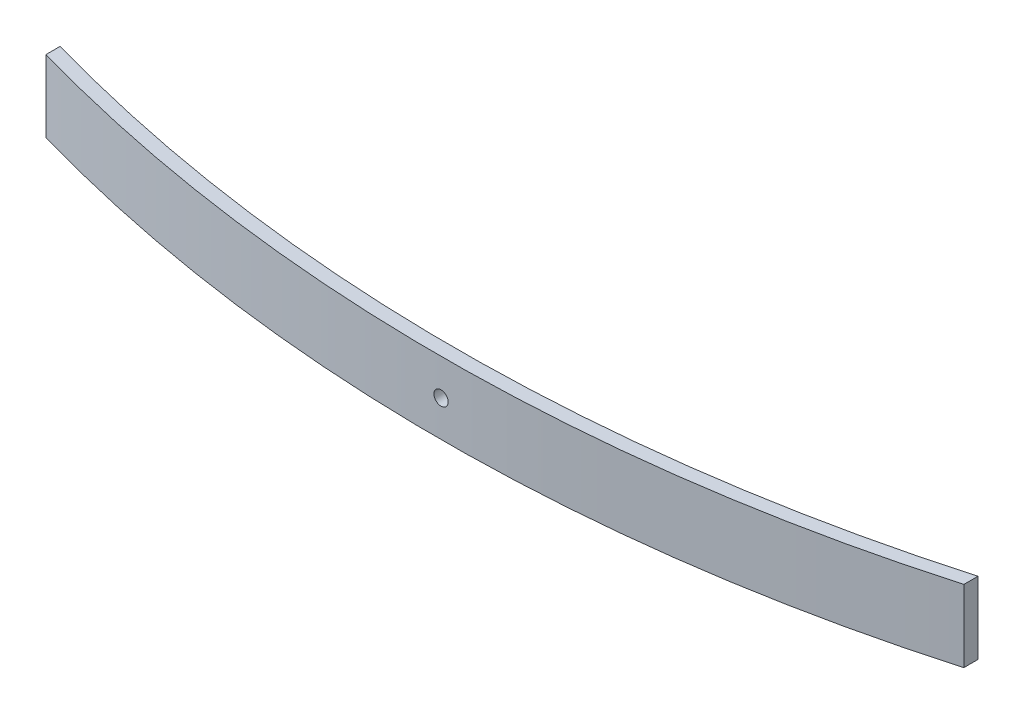
ISO-10303-21;
HEADER;
FILE_DESCRIPTION(('STEP AP214'),'2;1');
FILE_NAME('part.step','',(''),(''),'','','');
FILE_SCHEMA(('AUTOMOTIVE_DESIGN { 1 0 10303 214 1 1 1 1 }'));
ENDSEC;
DATA;
#1=APPLICATION_CONTEXT('core data for automotive mechanical design processes');
#2=APPLICATION_PROTOCOL_DEFINITION('international standard','automotive_design',2000,#1);
#3=PRODUCT_CONTEXT('',#1,'mechanical');
#4=PRODUCT('Part','Part','',(#3));
#5=PRODUCT_RELATED_PRODUCT_CATEGORY('part','',(#4));
#6=PRODUCT_DEFINITION_FORMATION('','',#4);
#7=PRODUCT_DEFINITION_CONTEXT('part definition',#1,'design');
#8=PRODUCT_DEFINITION('design','',#6,#7);
#9=PRODUCT_DEFINITION_SHAPE('','',#8);
#10=(LENGTH_UNIT() NAMED_UNIT(*) SI_UNIT(.MILLI.,.METRE.));
#11=(NAMED_UNIT(*) PLANE_ANGLE_UNIT() SI_UNIT($,.RADIAN.));
#12=(NAMED_UNIT(*) SI_UNIT($,.STERADIAN.) SOLID_ANGLE_UNIT());
#13=UNCERTAINTY_MEASURE_WITH_UNIT(LENGTH_MEASURE(1.E-05),#10,'distance_accuracy_value','');
#14=(GEOMETRIC_REPRESENTATION_CONTEXT(3) GLOBAL_UNCERTAINTY_ASSIGNED_CONTEXT((#13)) GLOBAL_UNIT_ASSIGNED_CONTEXT((#10,
#11,#12)) REPRESENTATION_CONTEXT('',''));
#15=CARTESIAN_POINT('',(0.,0.,0.));
#16=DIRECTION('',(0.,0.,1.));
#17=DIRECTION('',(1.,0.,0.));
#18=AXIS2_PLACEMENT_3D('',#15,#16,#17);
#19=CARTESIAN_POINT('',(5.63227548411192E-13,76.2,-1568.04997748713));
#20=DIRECTION('',(0.,-1.,0.));
#21=DIRECTION('',(0.,0.,-1.));
#22=AXIS2_PLACEMENT_3D('',#19,#20,#21);
#23=CYLINDRICAL_SURFACE('',#22,1776.04997748713);
#24=CARTESIAN_POINT('',(5.63227548411192E-13,0.,-1568.04997748713));
#25=DIRECTION('',(0.,1.,0.));
#26=DIRECTION('',(0.,0.,1.));
#27=AXIS2_PLACEMENT_3D('',#24,#25,#26);
#28=CIRCLE('',#27,1776.04997748713);
#29=CARTESIAN_POINT('',(485.021699517167,0.,140.4895958121));
#30=VERTEX_POINT('',#29);
#31=CARTESIAN_POINT('',(-485.021699517165,0.,140.4895958121));
#32=VERTEX_POINT('',#31);
#33=EDGE_CURVE('E122',#30,#32,#28,.F.);
#34=ORIENTED_EDGE('',*,*,#33,.F.);
#35=DIRECTION('',(0.,-1.,0.));
#36=VECTOR('',#35,1.);
#37=CARTESIAN_POINT('',(485.021699517167,76.2,140.4895958121));
#38=LINE('',#37,#36);
#39=CARTESIAN_POINT('',(485.021699517167,76.2,140.4895958121));
#40=VERTEX_POINT('',#39);
#41=EDGE_CURVE('E11',#40,#30,#38,.T.);
#42=ORIENTED_EDGE('',*,*,#41,.F.);
#43=CARTESIAN_POINT('',(5.63227548411192E-13,76.2,-1568.04997748713));
#44=DIRECTION('',(0.,1.,0.));
#45=DIRECTION('',(0.,0.,1.));
#46=AXIS2_PLACEMENT_3D('',#43,#44,#45);
#47=CIRCLE('',#46,1776.04997748713);
#48=CARTESIAN_POINT('',(-485.021699517165,76.2,140.4895958121));
#49=VERTEX_POINT('',#48);
#50=EDGE_CURVE('E115',#40,#49,#47,.F.);
#51=ORIENTED_EDGE('',*,*,#50,.T.);
#52=DIRECTION('',(0.,-1.,0.));
#53=VECTOR('',#52,1.);
#54=CARTESIAN_POINT('',(-485.021699517165,76.2,140.4895958121));
#55=LINE('',#54,#53);
#56=EDGE_CURVE('E94',#49,#32,#55,.T.);
#57=ORIENTED_EDGE('',*,*,#56,.T.);
#58=EDGE_LOOP('',(#34,#42,#51,#57));
#59=FACE_BOUND('',#58,.T.);
#60=CARTESIAN_POINT('',(5.63227548411192E-13,30.6,208.));
#61=CARTESIAN_POINT('',(-0.210713968094355,30.5999984867718,208.000000017793));
#62=CARTESIAN_POINT('',(-0.421403110930435,30.6088837241473,207.999962421728));
#63=CARTESIAN_POINT('',(-0.841354181845203,30.6443626478278,207.999813125687));
#64=CARTESIAN_POINT('',(-1.05061571988385,30.6709609920997,207.999701406219));
#65=CARTESIAN_POINT('',(-1.46633777348665,30.7417152082758,207.999406859924));
#66=CARTESIAN_POINT('',(-1.67279562512332,30.7858867143382,207.999223969782));
#67=CARTESIAN_POINT('',(-2.08132982906143,30.8914915499315,207.998792209094));
#68=CARTESIAN_POINT('',(-2.28340455125366,30.9529311869031,207.99854331444));
#69=CARTESIAN_POINT('',(-2.68152110119513,31.0925814227027,207.997986836868));
#70=CARTESIAN_POINT('',(-2.8775668723038,31.1707807807114,207.9976792933));
#71=CARTESIAN_POINT('',(-3.26237590887513,31.343419913298,207.997014137911));
#72=CARTESIAN_POINT('',(-3.45113906456097,31.4378599325676,207.996656525334));
#73=CARTESIAN_POINT('',(-3.81998780495984,31.6422805388216,207.995901490769));
#74=CARTESIAN_POINT('',(-4.00007570143485,31.7522569546404,207.995504079474));
#75=CARTESIAN_POINT('',(-4.35035222525608,31.9869905222909,207.994680636078));
#76=CARTESIAN_POINT('',(-4.52054062300119,32.1117480167396,207.994254603313));
#77=CARTESIAN_POINT('',(-4.84979170206691,32.3751451316166,207.993386048449));
#78=CARTESIAN_POINT('',(-5.00885520931077,32.5137837196362,207.992943527578));
#79=CARTESIAN_POINT('',(-5.31479308067797,32.8040158599571,207.992054369382));
#80=CARTESIAN_POINT('',(-5.4616632047591,32.9556138817968,207.991607730686));
#81=CARTESIAN_POINT('',(-5.74206362701614,33.2705952098564,207.990723311728));
#82=CARTESIAN_POINT('',(-5.87559815641345,33.4339747494297,207.990285528692));
#83=CARTESIAN_POINT('',(-6.12847828337024,33.7714630692386,207.989430939818));
#84=CARTESIAN_POINT('',(-6.24781862373899,33.9455757887629,207.989014141786));
#85=CARTESIAN_POINT('',(-6.47138111476831,34.303200530957,207.988213616074));
#86=CARTESIAN_POINT('',(-6.5756063932153,34.4867105983515,207.987829881559));
#87=CARTESIAN_POINT('',(-6.76822875919954,34.8618615632204,207.987106273531));
#88=CARTESIAN_POINT('',(-6.8566256006593,35.0535025870457,207.986766400699));
#89=CARTESIAN_POINT('',(-7.01695887812269,35.4435460971776,207.986140178145));
#90=CARTESIAN_POINT('',(-7.08889566823621,35.6419484379206,207.98585382727));
#91=CARTESIAN_POINT('',(-7.21580133308602,36.0441127387915,207.985342762279));
#92=CARTESIAN_POINT('',(-7.27076981084051,36.2478748241923,207.985118049605));
#93=CARTESIAN_POINT('',(-7.3633369917847,36.6592665254966,207.984736685149));
#94=CARTESIAN_POINT('',(-7.40093897454978,36.8668954034649,207.984580020515));
#95=CARTESIAN_POINT('',(-7.45853120590767,37.284654948294,207.984339094535));
#96=CARTESIAN_POINT('',(-7.47851535225068,37.4947864564639,207.984254858275));
#97=CARTESIAN_POINT('',(-7.5007035967929,37.9159102543567,207.984161289859));
#98=CARTESIAN_POINT('',(-7.50291408330494,38.12690220753,207.98415193079));
#99=CARTESIAN_POINT('',(-7.48955360463758,38.5484004665778,207.984208322118));
#100=CARTESIAN_POINT('',(-7.47397607404447,38.758906564384,207.984274100248));
#101=CARTESIAN_POINT('',(-7.42514452560696,39.177816026816,207.984478922777));
#102=CARTESIAN_POINT('',(-7.39189401428345,39.3862198002115,207.984617952642));
#103=CARTESIAN_POINT('',(-7.30795445093896,39.799488675094,207.984965325868));
#104=CARTESIAN_POINT('',(-7.25726512758638,40.0043537214696,207.985173670308));
#105=CARTESIAN_POINT('',(-7.13880941808665,40.4090816554469,207.985653753507));
#106=CARTESIAN_POINT('',(-7.07104334628338,40.6089446350508,207.9859254911));
#107=CARTESIAN_POINT('',(-6.9189140997811,41.0022558470399,207.986524655178));
#108=CARTESIAN_POINT('',(-6.83455053674644,41.1957039292103,207.986852082966));
#109=CARTESIAN_POINT('',(-6.64984230973407,41.5747716673118,207.987553267696));
#110=CARTESIAN_POINT('',(-6.54950055498276,41.7603927405774,207.9879270162));
#111=CARTESIAN_POINT('',(-6.33350673998455,42.1225834438656,207.988710406047));
#112=CARTESIAN_POINT('',(-6.21784939085673,42.2991499177422,207.989120059772));
#113=CARTESIAN_POINT('',(-5.97209494733994,42.6418601532704,207.98996341449));
#114=CARTESIAN_POINT('',(-5.84200303653234,42.8080076231481,207.990397106822));
#115=CARTESIAN_POINT('',(-5.56830511634755,43.1287715124284,207.99127634415));
#116=CARTESIAN_POINT('',(-5.42469413510178,43.2833836517495,207.991721893463));
#117=CARTESIAN_POINT('',(-4.97502421482223,43.728168500476,207.993057195178));
#118=CARTESIAN_POINT('',(-4.64986305950523,43.9996590137954,207.993946551662));
#119=CARTESIAN_POINT('',(-4.13197567971263,44.3627081259286,207.995201923407));
#120=CARTESIAN_POINT('',(-3.95423770702147,44.4764002086071,207.99560743072));
#121=CARTESIAN_POINT('',(-3.58980904910994,44.688450679073,207.996381434127));
#122=CARTESIAN_POINT('',(-3.40311815449547,44.7868087079932,207.996749929354));
#123=CARTESIAN_POINT('',(-2.83165300721137,45.0576661242203,207.99778332722));
#124=CARTESIAN_POINT('',(-2.43517114126777,45.2061693090256,207.998376934446));
#125=CARTESIAN_POINT('',(-1.62308827124603,45.4344169166339,207.999304792558));
#126=CARTESIAN_POINT('',(-1.20748726904302,45.5141613461806,207.999639043471));
#127=CARTESIAN_POINT('',(-0.368800144783707,45.6027859953174,208.000011208188));
#128=CARTESIAN_POINT('',(0.0542859194174483,45.6116667624026,208.000049124283));
#129=CARTESIAN_POINT('',(0.896132618130838,45.5581931101372,207.999823726226));
#130=CARTESIAN_POINT('',(1.31489325255124,45.4958386892741,207.999560412068));
#131=CARTESIAN_POINT('',(1.93034367877353,45.3504066256681,207.998962948761));
#132=CARTESIAN_POINT('',(2.13346696571742,45.2932419084604,207.998729895662));
#133=CARTESIAN_POINT('',(2.53416331768141,45.1620457959662,207.998203357605));
#134=CARTESIAN_POINT('',(2.73173651249186,45.0880147954716,207.997909874061));
#135=CARTESIAN_POINT('',(3.31406084676297,44.8412313409883,207.996950242197));
#136=CARTESIAN_POINT('',(3.68878109502314,44.6437020734129,207.996204537468));
#137=CARTESIAN_POINT('',(4.2214817885536,44.3027303934533,207.994991984489));
#138=CARTESIAN_POINT('',(4.39423732139167,44.1815494254653,207.99457188216));
#139=CARTESIAN_POINT('',(4.72893486876232,43.925076010294,207.993712173886));
#140=CARTESIAN_POINT('',(4.89088085068062,43.7897887877035,207.993272575197));
#141=CARTESIAN_POINT('',(5.2028389741046,43.5060131269227,207.992386135608));
#142=CARTESIAN_POINT('',(5.35284682055907,43.3575199778823,207.991939292171));
#143=CARTESIAN_POINT('',(5.63977310900379,43.0484737070597,207.99105133538));
#144=CARTESIAN_POINT('',(5.77669606336983,42.8879247771164,207.990610220096));
#145=CARTESIAN_POINT('',(6.03655633591662,42.5558335361284,207.989746002998));
#146=CARTESIAN_POINT('',(6.15949097179744,42.3842891264948,207.989322904648));
#147=CARTESIAN_POINT('',(6.39046942201523,42.0314575902562,207.98850682996));
#148=CARTESIAN_POINT('',(6.49851358458251,41.8501706916281,207.988113852919));
#149=CARTESIAN_POINT('',(6.69894774113194,41.4791360457972,207.987369158747));
#150=CARTESIAN_POINT('',(6.79133744698049,41.2893881429437,207.987017442377));
#151=CARTESIAN_POINT('',(6.95980221242444,40.9027865931228,207.986365267457));
#152=CARTESIAN_POINT('',(7.03587752593875,40.705933056804,207.986064808109));
#153=CARTESIAN_POINT('',(7.17118720449912,40.3064792017959,207.985523618733));
#154=CARTESIAN_POINT('',(7.23041839084972,40.1038778063372,207.985282899979));
#155=CARTESIAN_POINT('',(7.33158072491739,39.6944803968456,207.98486817799));
#156=CARTESIAN_POINT('',(7.37351824975517,39.4876859585838,207.984694150165));
#157=CARTESIAN_POINT('',(7.43983858987235,39.0712246263163,207.984417572838));
#158=CARTESIAN_POINT('',(7.4642150889778,38.8615567264145,207.984315049055));
#159=CARTESIAN_POINT('',(7.49521005598158,38.4409854893945,207.984184515178));
#160=CARTESIAN_POINT('',(7.50183466739308,38.2300826050058,207.984156479306));
#161=CARTESIAN_POINT('',(7.49729604901427,37.8084313167292,207.984175644233));
#162=CARTESIAN_POINT('',(7.48612970385176,37.5976829463638,207.984222858209));
#163=CARTESIAN_POINT('',(7.44608319144547,37.1778810074965,207.984391205324));
#164=CARTESIAN_POINT('',(7.41720343879291,36.9688273994438,207.984512336734));
#165=CARTESIAN_POINT('',(7.34193498439921,36.5538917028778,207.984825082016));
#166=CARTESIAN_POINT('',(7.29554590651523,36.3480096825967,207.985016697403));
#167=CARTESIAN_POINT('',(7.18558954382438,35.940888673502,207.985464967259));
#168=CARTESIAN_POINT('',(7.12202252604803,35.7396496125665,207.985721620717));
#169=CARTESIAN_POINT('',(6.97814667319743,35.3431999543693,207.986292743016));
#170=CARTESIAN_POINT('',(6.89783430858557,35.1479906380157,207.986607224045));
#171=CARTESIAN_POINT('',(6.72107980430777,34.7651040508121,207.987284909401));
#172=CARTESIAN_POINT('',(6.62464362886664,34.5774240265771,207.987648095704));
#173=CARTESIAN_POINT('',(6.4162729052852,34.210795083937,207.988413096412));
#174=CARTESIAN_POINT('',(6.30433343128906,34.0318489650877,207.988814923083));
#175=CARTESIAN_POINT('',(6.06581689289934,33.684084736122,207.989645553125));
#176=CARTESIAN_POINT('',(5.93924490882288,33.5152631415669,207.990074347111));
#177=CARTESIAN_POINT('',(5.67231991868927,33.1888660580896,207.990946907972));
#178=CARTESIAN_POINT('',(5.53196570521919,33.031291556578,207.991390676157));
#179=CARTESIAN_POINT('',(5.23848659589233,32.728528501031,207.992280544971));
#180=CARTESIAN_POINT('',(5.08536199605376,32.583339660053,207.992726645546));
#181=CARTESIAN_POINT('',(4.76738488124505,32.3063385507571,207.993608647806));
#182=CARTESIAN_POINT('',(4.60252923302726,32.1745298791339,207.994044546725));
#183=CARTESIAN_POINT('',(4.26230143452273,31.9252727160437,207.994893638276));
#184=CARTESIAN_POINT('',(4.08692944268934,31.8078240082911,207.99530683125));
#185=CARTESIAN_POINT('',(3.7267922464464,31.5880456665331,207.996099052417));
#186=CARTESIAN_POINT('',(3.54202080718466,31.4857262486001,207.996478057458));
#187=CARTESIAN_POINT('',(3.16457932589543,31.2970641063271,207.997190684132));
#188=CARTESIAN_POINT('',(2.97191219636474,31.2107155544448,207.997524322307));
#189=CARTESIAN_POINT('',(2.58015719959604,31.0546324777028,207.998136625653));
#190=CARTESIAN_POINT('',(2.38107520557386,30.9848832197952,207.998415339535));
#191=CARTESIAN_POINT('',(1.97781144430207,30.8624129523239,207.998910200255));
#192=CARTESIAN_POINT('',(1.77363103212953,30.8096874689386,207.999126363529));
#193=CARTESIAN_POINT('',(1.31020489979084,30.7106430274462,207.999535351372));
#194=CARTESIAN_POINT('',(1.04990557260813,30.6691871109607,207.99970896714));
#195=CARTESIAN_POINT('',(0.526391255000924,30.6138665423076,207.999941280342));
#196=CARTESIAN_POINT('',(0.263176264593045,30.6000018899827,207.999999977777));
#197=CARTESIAN_POINT('',(5.63227548411192E-13,30.6,208.));
#198=B_SPLINE_CURVE_WITH_KNOTS('',3,(#60,#61,#62,#63,#64,#65,#66,#67,#68,#69,#70,#71,#72,#73,
#74,#75,#76,#77,#78,#79,#80,#81,#82,#83,#84,#85,#86,#87,#88,#89,#90,#91,#92,#93,#94,#95,#96,#97,
#98,#99,#100,#101,#102,#103,#104,#105,#106,#107,#108,#109,#110,#111,#112,#113,#114,#115,#116,
#117,#118,#119,#120,#121,#122,#123,#124,#125,#126,#127,#128,#129,#130,#131,#132,#133,#134,#135,
#136,#137,#138,#139,#140,#141,#142,#143,#144,#145,#146,#147,#148,#149,#150,#151,#152,#153,#154,
#155,#156,#157,#158,#159,#160,#161,#162,#163,#164,#165,#166,#167,#168,#169,#170,#171,#172,#173,
#174,#175,#176,#177,#178,#179,#180,#181,#182,#183,#184,#185,#186,#187,#188,#189,#190,#191,#192,
#193,#194,#195,#196,#197),.UNSPECIFIED.,.T.,.F.,(4,2,2,2,2,2,2,2,2,2,2,2,2,2,2,2,2,2,2,2,2,2,2,
2,2,2,2,2,2,2,2,2,2,2,2,2,2,2,2,2,2,2,2,2,2,2,2,2,2,2,2,2,2,2,2,2,2,2,2,2,2,2,2,2,2,2,2,2,4),
(0.,0.631912024301777,1.2639902864152,1.89663214600144,2.52950538839113,3.16195548087539,
3.79441510307562,4.4267052459563,5.0590100478297,5.69126785680884,6.32374460980309,
6.95602004377835,7.58852893310258,8.22090674891289,8.85329439515874,9.48566843538514,
10.1180572691842,10.7503266306474,11.3828149038618,12.0150758342728,12.6475702025455,
13.2799391235442,13.9123178840565,14.5446850047721,15.177066922899,15.8093338315781,
16.4418196509556,17.0740790696136,17.7065719276866,18.9702098092056,19.602583667419,
20.2349723230349,21.4986105469059,22.7622486468442,24.0258769838608,25.2895053477042,
25.9218869189979,26.5542536895501,27.8178774792359,28.450372115571,29.0826333187677,
29.7151209754032,30.3473897231102,30.9797795065627,31.6121544983652,32.2445411283047,
32.8769179149983,33.5094139599539,34.1416765599364,34.7741664524213,35.4064374266601,
36.0388191299599,36.6711860326123,37.3035665208154,37.9359371792494,38.5684412619989,
39.2007118959496,39.8331838838019,40.4654369370645,41.097745429307,41.7300392686787,
42.3625026260201,42.9949564562123,43.6278354202829,44.2604829982539,44.892566944869,
45.5244846453389,46.3137263294984,47.1029680091572),.UNSPECIFIED.);
#199=CARTESIAN_POINT('',(5.63227548411192E-13,30.6,208.));
#200=VERTEX_POINT('',#199);
#201=EDGE_CURVE('E125',#200,#200,#198,.T.);
#202=ORIENTED_EDGE('',*,*,#201,.T.);
#203=EDGE_LOOP('',(#202));
#204=FACE_BOUND('',#203,.T.);
#205=ADVANCED_FACE('F49',(#59,#204),#23,.T.);
#206=CARTESIAN_POINT('',(6.91954253005793E-13,76.2,-1583.04997748713));
#207=DIRECTION('',(0.,-1.,0.));
#208=DIRECTION('',(0.,0.,-1.));
#209=AXIS2_PLACEMENT_3D('',#206,#207,#208);
#210=CYLINDRICAL_SURFACE('',#209,1776.04997748713);
#211=CARTESIAN_POINT('',(6.91954253005793E-13,0.,-1583.04997748713));
#212=DIRECTION('',(0.,1.,0.));
#213=DIRECTION('',(0.,0.,1.));
#214=AXIS2_PLACEMENT_3D('',#211,#212,#213);
#215=CIRCLE('',#214,1776.04997748713);
#216=CARTESIAN_POINT('',(485.021699517167,0.,125.4895958121));
#217=VERTEX_POINT('',#216);
#218=CARTESIAN_POINT('',(-485.021699517165,0.,125.4895958121));
#219=VERTEX_POINT('',#218);
#220=EDGE_CURVE('E87',#217,#219,#215,.F.);
#221=ORIENTED_EDGE('',*,*,#220,.T.);
#222=DIRECTION('',(0.,-1.,0.));
#223=VECTOR('',#222,1.);
#224=CARTESIAN_POINT('',(-485.021699517165,76.2,125.4895958121));
#225=LINE('',#224,#223);
#226=CARTESIAN_POINT('',(-485.021699517165,76.2,125.4895958121));
#227=VERTEX_POINT('',#226);
#228=EDGE_CURVE('E108',#227,#219,#225,.T.);
#229=ORIENTED_EDGE('',*,*,#228,.F.);
#230=CARTESIAN_POINT('',(6.91954253005793E-13,76.2,-1583.04997748713));
#231=DIRECTION('',(0.,1.,0.));
#232=DIRECTION('',(0.,0.,1.));
#233=AXIS2_PLACEMENT_3D('',#230,#231,#232);
#234=CIRCLE('',#233,1776.04997748713);
#235=CARTESIAN_POINT('',(485.021699517167,76.2,125.4895958121));
#236=VERTEX_POINT('',#235);
#237=EDGE_CURVE('E110',#236,#227,#234,.F.);
#238=ORIENTED_EDGE('',*,*,#237,.F.);
#239=DIRECTION('',(0.,-1.,0.));
#240=VECTOR('',#239,1.);
#241=CARTESIAN_POINT('',(485.021699517167,76.2,125.4895958121));
#242=LINE('',#241,#240);
#243=EDGE_CURVE('E64',#236,#217,#242,.T.);
#244=ORIENTED_EDGE('',*,*,#243,.T.);
#245=EDGE_LOOP('',(#221,#229,#238,#244));
#246=FACE_BOUND('',#245,.T.);
#247=CARTESIAN_POINT('',(-7.5,38.1,192.984164226377));
#248=CARTESIAN_POINT('',(-7.50000151322819,38.3107139680855,192.984164208571));
#249=CARTESIAN_POINT('',(-7.49111627585349,38.5214031109122,192.984201804954));
#250=CARTESIAN_POINT('',(-7.45563735217615,38.9413541818078,192.984351102375));
#251=CARTESIAN_POINT('',(-7.42903900790671,39.1506157198367,192.984462822905));
#252=CARTESIAN_POINT('',(-7.35828479173724,39.56633777342,192.984757371678));
#253=CARTESIAN_POINT('',(-7.31411328567894,39.7727956250468,192.984940263235));
#254=CARTESIAN_POINT('',(-7.208508450096,40.181329828965,192.985372027225));
#255=CARTESIAN_POINT('',(-7.14706881313061,40.3834045511471,192.985620923766));
#256=CARTESIAN_POINT('',(-7.00741857734594,40.781521101067,192.98617740523));
#257=CARTESIAN_POINT('',(-6.92921921934607,40.9775668721644,192.986484950802));
#258=CARTESIAN_POINT('',(-6.75658008677935,41.362375908714,192.987150110131));
#259=CARTESIAN_POINT('',(-6.66214006752074,41.5511390643896,192.987507724643));
#260=CARTESIAN_POINT('',(-6.45771946129041,41.9199878047696,192.988262762777));
#261=CARTESIAN_POINT('',(-6.34774304548433,42.1000757012362,192.988660175705));
#262=CARTESIAN_POINT('',(-6.11300947786033,42.4503522250429,192.989483621892));
#263=CARTESIAN_POINT('',(-5.98825198342546,42.6205406227819,192.989909655814));
#264=CARTESIAN_POINT('',(-5.72485486856214,42.9497917018563,192.990778212374));
#265=CARTESIAN_POINT('',(-5.58621628054089,43.1088552091137,192.991220733785));
#266=CARTESIAN_POINT('',(-5.29598414021393,43.4147930805081,192.992109892413));
#267=CARTESIAN_POINT('',(-5.14438611836974,43.5616632046028,192.992556531002));
#268=CARTESIAN_POINT('',(-4.82940479029845,43.8420636268864,192.993440949047));
#269=CARTESIAN_POINT('',(-4.66602525071788,43.9755981562967,192.993878731277));
#270=CARTESIAN_POINT('',(-4.32853693089197,44.2284782832785,192.994733317997));
#271=CARTESIAN_POINT('',(-4.15442421135789,44.3478186236592,192.99515011468));
#272=CARTESIAN_POINT('',(-3.79679946915635,44.5713811147018,192.995950637268));
#273=CARTESIAN_POINT('',(-3.61328940176485,44.6756063931513,192.996334370008));
#274=CARTESIAN_POINT('',(-3.23813843690194,44.868228759141,192.997057974284));
#275=CARTESIAN_POINT('',(-3.04649741307953,44.9566256006036,192.997397845139));
#276=CARTESIAN_POINT('',(-2.65645390295346,45.116958878073,192.998024063725));
#277=CARTESIAN_POINT('',(-2.45805156221349,45.1888956681897,192.998310412606));
#278=CARTESIAN_POINT('',(-2.05588726134913,45.3158013330459,192.998821473857));
#279=CARTESIAN_POINT('',(-1.85212517595196,45.3707698108037,192.999046184785));
#280=CARTESIAN_POINT('',(-1.44073347465677,45.4633369917546,192.999427546169));
#281=CARTESIAN_POINT('',(-1.23310459669403,45.5009389745232,192.999584209475));
#282=CARTESIAN_POINT('',(-0.815345051876456,45.5585312058889,192.999825133398));
#283=CARTESIAN_POINT('',(-0.605213543712584,45.5785153522362,192.999909368927));
#284=CARTESIAN_POINT('',(-0.184089745831481,45.6007035967881,193.000002936514));
#285=CARTESIAN_POINT('',(0.0269022073360964,45.6029140833055,193.000012295484));
#286=CARTESIAN_POINT('',(0.448400466373142,45.5895536046497,192.999955904648));
#287=CARTESIAN_POINT('',(0.658906564174372,45.5739760740628,192.999890127109));
#288=CARTESIAN_POINT('',(1.07781602663256,45.5251445256344,192.999685306357));
#289=CARTESIAN_POINT('',(1.28621980005894,45.4918940143109,192.999546277678));
#290=CARTESIAN_POINT('',(1.69948867500321,45.407954450961,192.999198907313));
#291=CARTESIAN_POINT('',(1.90435372140975,45.357265127603,192.998990564549));
#292=CARTESIAN_POINT('',(2.30908165544807,45.2388094180872,192.998510484954));
#293=CARTESIAN_POINT('',(2.50894463508203,45.1710433462732,192.998238749291));
#294=CARTESIAN_POINT('',(2.90225584712975,45.0189140997444,192.997639589154));
#295=CARTESIAN_POINT('',(3.09570392932878,44.9345505366938,192.997312163378));
#296=CARTESIAN_POINT('',(3.474771667466,44.7498423096539,192.996610982501));
#297=CARTESIAN_POINT('',(3.6603927407395,44.6495005548925,192.996237235837));
#298=CARTESIAN_POINT('',(4.02258344404181,44.433506739873,192.995453849319));
#299=CARTESIAN_POINT('',(4.1991499179246,44.3178493907339,192.995044197083));
#300=CARTESIAN_POINT('',(4.54186015346291,44.0720949471939,192.994200844778));
#301=CARTESIAN_POINT('',(4.70800762334452,43.9420030363744,192.993767153369));
#302=CARTESIAN_POINT('',(5.02877151263007,43.6683051161658,192.992887917265));
#303=CARTESIAN_POINT('',(5.18338365195258,43.524694134908,192.992442368252));
#304=CARTESIAN_POINT('',(5.62816850065028,43.075024214623,192.991107066408));
#305=CARTESIAN_POINT('',(5.89965901394052,42.7498630593184,192.990217708469));
#306=CARTESIAN_POINT('',(6.26270812603403,42.231975679552,192.988962332908));
#307=CARTESIAN_POINT('',(6.37640020870004,42.0542377068708,192.988556824049));
#308=CARTESIAN_POINT('',(6.58845067914274,41.689809048981,192.987782817221));
#309=CARTESIAN_POINT('',(6.68680870805227,41.5031181543784,192.987414320118));
#310=CARTESIAN_POINT('',(6.95766612427186,40.9316530070874,192.986380916429));
#311=CARTESIAN_POINT('',(7.10616930907641,40.5351711411231,192.985787305057));
#312=CARTESIAN_POINT('',(7.33441691667697,39.7230882710565,192.98485943989));
#313=CARTESIAN_POINT('',(7.4141613462167,39.3074872688294,192.98452518607));
#314=CARTESIAN_POINT('',(7.50278599532745,38.4688001445599,192.98415301811));
#315=CARTESIAN_POINT('',(7.51166676240022,38.0457140803734,192.984115101681));
#316=CARTESIAN_POINT('',(7.45819311011506,37.2038673816924,192.984340501734));
#317=CARTESIAN_POINT('',(7.39583868924482,36.7851067472898,192.984603818221));
#318=CARTESIAN_POINT('',(7.25040662563846,36.1696563211186,192.985201286274));
#319=CARTESIAN_POINT('',(7.19324190843678,35.9665330342062,192.985434341165));
#320=CARTESIAN_POINT('',(7.06204579596008,35.5658366823044,192.98596088302));
#321=CARTESIAN_POINT('',(6.988014795477,35.3682634875246,192.986254368569));
#322=CARTESIAN_POINT('',(6.74123134103598,34.7859391533421,192.987214006388));
#323=CARTESIAN_POINT('',(6.54370207349932,34.4112189051374,192.987959715012));
#324=CARTESIAN_POINT('',(6.20273039359089,33.8785182116486,192.98917227251));
#325=CARTESIAN_POINT('',(6.08154942560717,33.7057626788045,192.989592376125));
#326=CARTESIAN_POINT('',(5.82507601044283,33.3710651314208,192.990452086404));
#327=CARTESIAN_POINT('',(5.68978878785503,33.2091191494955,192.990891685812));
#328=CARTESIAN_POINT('',(5.40601312707813,32.8971610260567,192.991778126146));
#329=CARTESIAN_POINT('',(5.25751997803878,32.7471531795944,192.99222496961));
#330=CARTESIAN_POINT('',(4.94847370721619,32.4602268911334,192.993112925805));
#331=CARTESIAN_POINT('',(4.787924777272,32.3233039367589,192.993554040465));
#332=CARTESIAN_POINT('',(4.45583353628018,32.0634436641952,192.994418255711));
#333=CARTESIAN_POINT('',(4.28428912664368,31.9405090283058,192.994841352831));
#334=CARTESIAN_POINT('',(3.9314575903977,31.7095305780715,192.995657424618));
#335=CARTESIAN_POINT('',(3.75017069176504,31.6014864154963,192.996050399988));
#336=CARTESIAN_POINT('',(3.37913604592411,31.4010522589318,192.99679509052));
#337=CARTESIAN_POINT('',(3.18938814306502,31.3086625530762,192.997146804922));
#338=CARTESIAN_POINT('',(2.80278659323258,31.1401977876195,192.997798975874));
#339=CARTESIAN_POINT('',(2.60593305690778,31.0641224740995,192.998099433222));
#340=CARTESIAN_POINT('',(2.20647920190444,30.9288127955346,192.998640618766));
#341=CARTESIAN_POINT('',(2.00387780645707,30.8695816091838,192.998881335688));
#342=CARTESIAN_POINT('',(1.59448039698904,30.7684192751141,192.999296054415));
#343=CARTESIAN_POINT('',(1.38768595873947,30.7264817502745,192.99947008081));
#344=CARTESIAN_POINT('',(0.971224626496971,30.6601614101516,192.999746655793));
#345=CARTESIAN_POINT('',(0.761556726607792,30.6357849110423,192.999849178663));
#346=CARTESIAN_POINT('',(0.340985489613199,30.6047899440287,192.999979711378));
#347=CARTESIAN_POINT('',(0.130082605237175,30.5981653326113,193.000007747002));
#348=CARTESIAN_POINT('',(-0.29156868304871,30.6027039509765,192.999988582247));
#349=CARTESIAN_POINT('',(-0.502317053436069,30.6138702961342,192.99994136869));
#350=CARTESIAN_POINT('',(-0.922118992347893,30.6539168085346,192.999773023057));
#351=CARTESIAN_POINT('',(-1.13117260042309,30.6827965611862,192.99965189271));
#352=CARTESIAN_POINT('',(-1.54610829703443,30.7580650155817,192.999339150039));
#353=CARTESIAN_POINT('',(-1.75199031733827,30.8044540934685,192.9991475362));
#354=CARTESIAN_POINT('',(-2.15911132647842,30.9144104561691,192.998699269789));
#355=CARTESIAN_POINT('',(-2.36035038743662,30.9779774739523,192.998442618228));
#356=CARTESIAN_POINT('',(-2.75680004567823,31.1218533268206,192.997871499833));
#357=CARTESIAN_POINT('',(-2.95200936205343,31.2021656914433,192.997557020813));
#358=CARTESIAN_POINT('',(-3.33489594929877,31.3789201957465,192.99687933939));
#359=CARTESIAN_POINT('',(-3.52257597355382,31.4753563712022,192.996516155014));
#360=CARTESIAN_POINT('',(-3.88920491623114,31.6837270948159,192.995751157795));
#361=CARTESIAN_POINT('',(-4.06815103509762,31.7956665688298,192.995349332688));
#362=CARTESIAN_POINT('',(-4.41591526409443,32.0341831072574,192.994518705298));
#363=CARTESIAN_POINT('',(-4.58473685866347,32.1607550913541,192.994089912401));
#364=CARTESIAN_POINT('',(-4.9111339421384,32.4276800815086,192.993217353088));
#365=CARTESIAN_POINT('',(-5.06870844363561,32.568034294977,192.992773585362));
#366=CARTESIAN_POINT('',(-5.37147149915389,32.8615134042977,192.991883716795));
#367=CARTESIAN_POINT('',(-5.51666034011747,33.0146380041317,192.991437616008));
#368=CARTESIAN_POINT('',(-5.79366144938522,33.3326151189285,192.99055561267));
#369=CARTESIAN_POINT('',(-5.9254701209946,33.4974707671389,192.990119712884));
#370=CARTESIAN_POINT('',(-6.17472728405848,33.8376985656261,192.989270619054));
#371=CARTESIAN_POINT('',(-6.29217599179849,34.0130705574495,192.988857424669));
#372=CARTESIAN_POINT('',(-6.51195433354262,34.3732077536857,192.988065200254));
#373=CARTESIAN_POINT('',(-6.61427375147285,34.5579791929515,192.987686193377));
#374=CARTESIAN_POINT('',(-6.80293589374009,34.935420674249,192.986973562954));
#375=CARTESIAN_POINT('',(-6.88928444561939,35.1280878037838,192.986639922868));
#376=CARTESIAN_POINT('',(-7.04536752235469,35.5198428005607,192.986027615559));
#377=CARTESIAN_POINT('',(-7.11511678025875,35.7189247945869,192.985748899626));
#378=CARTESIAN_POINT('',(-7.23758704772251,36.1221885558675,192.985254035172));
#379=CARTESIAN_POINT('',(-7.29031253110392,36.3263689680447,192.985037870214));
#380=CARTESIAN_POINT('',(-7.38935697257925,36.789795100359,192.984628879072));
#381=CARTESIAN_POINT('',(-7.43081288905515,37.050094427512,192.984455261811));
#382=CARTESIAN_POINT('',(-7.48613345769553,37.5736087450595,192.984222946583));
#383=CARTESIAN_POINT('',(-7.49999811001735,37.8368237354374,192.984164248616));
#384=CARTESIAN_POINT('',(-7.5,38.1,192.984164226377));
#385=B_SPLINE_CURVE_WITH_KNOTS('',3,(#247,#248,#249,#250,#251,#252,#253,#254,#255,#256,#257,
#258,#259,#260,#261,#262,#263,#264,#265,#266,#267,#268,#269,#270,#271,#272,#273,#274,#275,#276,
#277,#278,#279,#280,#281,#282,#283,#284,#285,#286,#287,#288,#289,#290,#291,#292,#293,#294,#295,
#296,#297,#298,#299,#300,#301,#302,#303,#304,#305,#306,#307,#308,#309,#310,#311,#312,#313,#314,
#315,#316,#317,#318,#319,#320,#321,#322,#323,#324,#325,#326,#327,#328,#329,#330,#331,#332,#333,
#334,#335,#336,#337,#338,#339,#340,#341,#342,#343,#344,#345,#346,#347,#348,#349,#350,#351,#352,
#353,#354,#355,#356,#357,#358,#359,#360,#361,#362,#363,#364,#365,#366,#367,#368,#369,#370,#371,
#372,#373,#374,#375,#376,#377,#378,#379,#380,#381,#382,#383,#384),.UNSPECIFIED.,.T.,.F.,(4,2,2,
2,2,2,2,2,2,2,2,2,2,2,2,2,2,2,2,2,2,2,2,2,2,2,2,2,2,2,2,2,2,2,2,2,2,2,2,2,2,2,2,2,2,2,2,2,2,2,2,
2,2,2,2,2,2,2,2,2,2,2,2,2,2,2,2,2,4),(0.,0.631912024273445,1.26399028635864,1.89663214591711,
2.52950538827904,3.16195548073079,3.79441510289857,4.42670524574721,5.05901004758862,
5.69126785660492,6.32374460963637,6.95602004364789,7.58852893300835,8.22090674880479,
8.85329439503679,9.48566843524988,10.1180572690357,10.7503266304816,11.3828149036786,
12.015075834073,12.6475702023291,13.2799391234167,13.9123178840178,14.5446850048214,
15.1770669230362,15.8093338317406,16.4418196511433,17.0740790698267,17.7065719279251,
18.9702098093707,19.6025836675478,20.2349723231275,21.4986105470723,22.7622486470823,
24.0258769840529,25.2895053478503,25.9218869190543,26.554253689517,27.8178774790259,
28.4503721153762,29.0826333185882,29.7151209752384,30.3473897229599,30.9797795064268,
31.6121544982437,32.2445411281974,32.8769179149055,33.5094139598227,34.1416765597669,
34.7741664522143,35.4064374264159,36.0388191297804,36.6711860324976,37.3035665207648,
37.9359371792628,38.5684412620756,39.2007118960894,39.8331838840045,40.4654369373298,
41.0977454295341,41.7300392688676,42.3625026261715,42.9949564563263,43.6278354204137,
44.2604829984014,44.8925669450324,45.5244846455181,46.313726329588,47.1029680091571),.UNSPECIFIED.);
#386=CARTESIAN_POINT('',(-7.5,38.1,192.984164226377));
#387=VERTEX_POINT('',#386);
#388=EDGE_CURVE('E53',#387,#387,#385,.T.);
#389=ORIENTED_EDGE('',*,*,#388,.F.);
#390=EDGE_LOOP('',(#389));
#391=FACE_BOUND('',#390,.T.);
#392=ADVANCED_FACE('F111',(#246,#391),#210,.F.);
#393=CARTESIAN_POINT('',(485.021699517167,76.2,0.));
#394=DIRECTION('',(1.,0.,0.));
#395=DIRECTION('',(0.,0.,-1.));
#396=AXIS2_PLACEMENT_3D('',#393,#394,#395);
#397=PLANE('',#396);
#398=DIRECTION('',(0.,0.,1.));
#399=VECTOR('',#398,1.);
#400=CARTESIAN_POINT('',(485.021699517167,0.,0.));
#401=LINE('',#400,#399);
#402=EDGE_CURVE('E107',#217,#30,#401,.T.);
#403=ORIENTED_EDGE('',*,*,#402,.F.);
#404=ORIENTED_EDGE('',*,*,#243,.F.);
#405=DIRECTION('',(0.,0.,1.));
#406=VECTOR('',#405,1.);
#407=CARTESIAN_POINT('',(485.021699517167,76.2,0.));
#408=LINE('',#407,#406);
#409=EDGE_CURVE('E105',#236,#40,#408,.T.);
#410=ORIENTED_EDGE('',*,*,#409,.T.);
#411=ORIENTED_EDGE('',*,*,#41,.T.);
#412=EDGE_LOOP('',(#403,#404,#410,#411));
#413=FACE_BOUND('',#412,.T.);
#414=ADVANCED_FACE('F103',(#413),#397,.T.);
#415=CARTESIAN_POINT('',(-485.021699517165,76.2,0.));
#416=DIRECTION('',(1.,0.,0.));
#417=DIRECTION('',(0.,0.,-1.));
#418=AXIS2_PLACEMENT_3D('',#415,#416,#417);
#419=PLANE('',#418);
#420=DIRECTION('',(0.,0.,1.));
#421=VECTOR('',#420,1.);
#422=CARTESIAN_POINT('',(-485.021699517165,0.,0.));
#423=LINE('',#422,#421);
#424=EDGE_CURVE('E117',#219,#32,#423,.T.);
#425=ORIENTED_EDGE('',*,*,#424,.T.);
#426=ORIENTED_EDGE('',*,*,#56,.F.);
#427=DIRECTION('',(0.,0.,1.));
#428=VECTOR('',#427,1.);
#429=CARTESIAN_POINT('',(-485.021699517165,76.2,0.));
#430=LINE('',#429,#428);
#431=EDGE_CURVE('E72',#227,#49,#430,.T.);
#432=ORIENTED_EDGE('',*,*,#431,.F.);
#433=ORIENTED_EDGE('',*,*,#228,.T.);
#434=EDGE_LOOP('',(#425,#426,#432,#433));
#435=FACE_BOUND('',#434,.T.);
#436=ADVANCED_FACE('F132',(#435),#419,.F.);
#437=CARTESIAN_POINT('',(0.,76.2,0.));
#438=DIRECTION('',(0.,1.,0.));
#439=DIRECTION('',(0.,0.,1.));
#440=AXIS2_PLACEMENT_3D('',#437,#438,#439);
#441=PLANE('',#440);
#442=ORIENTED_EDGE('',*,*,#50,.F.);
#443=ORIENTED_EDGE('',*,*,#409,.F.);
#444=ORIENTED_EDGE('',*,*,#237,.T.);
#445=ORIENTED_EDGE('',*,*,#431,.T.);
#446=EDGE_LOOP('',(#442,#443,#444,#445));
#447=FACE_BOUND('',#446,.T.);
#448=ADVANCED_FACE('F114',(#447),#441,.T.);
#449=CARTESIAN_POINT('',(0.,0.,0.));
#450=DIRECTION('',(0.,1.,0.));
#451=DIRECTION('',(0.,0.,1.));
#452=AXIS2_PLACEMENT_3D('',#449,#450,#451);
#453=PLANE('',#452);
#454=ORIENTED_EDGE('',*,*,#33,.T.);
#455=ORIENTED_EDGE('',*,*,#424,.F.);
#456=ORIENTED_EDGE('',*,*,#220,.F.);
#457=ORIENTED_EDGE('',*,*,#402,.T.);
#458=EDGE_LOOP('',(#454,#455,#456,#457));
#459=FACE_BOUND('',#458,.T.);
#460=ADVANCED_FACE('F134',(#459),#453,.F.);
#461=CARTESIAN_POINT('',(0.,38.1,208.));
#462=DIRECTION('',(0.,0.,-1.));
#463=DIRECTION('',(-1.,0.,0.));
#464=AXIS2_PLACEMENT_3D('',#461,#462,#463);
#465=CYLINDRICAL_SURFACE('',#464,7.5);
#466=ORIENTED_EDGE('',*,*,#201,.F.);
#467=EDGE_LOOP('',(#466));
#468=FACE_BOUND('',#467,.T.);
#469=ORIENTED_EDGE('',*,*,#388,.T.);
#470=EDGE_LOOP('',(#469));
#471=FACE_BOUND('',#470,.T.);
#472=ADVANCED_FACE('F144',(#468,#471),#465,.F.);
#473=CLOSED_SHELL('',(#205,#392,#414,#436,#448,#460,#472));
#474=MANIFOLD_SOLID_BREP('B2',#473);
#475=ADVANCED_BREP_SHAPE_REPRESENTATION('',(#18,#474),#14);
#476=SHAPE_DEFINITION_REPRESENTATION(#9,#475);
ENDSEC;
END-ISO-10303-21;
